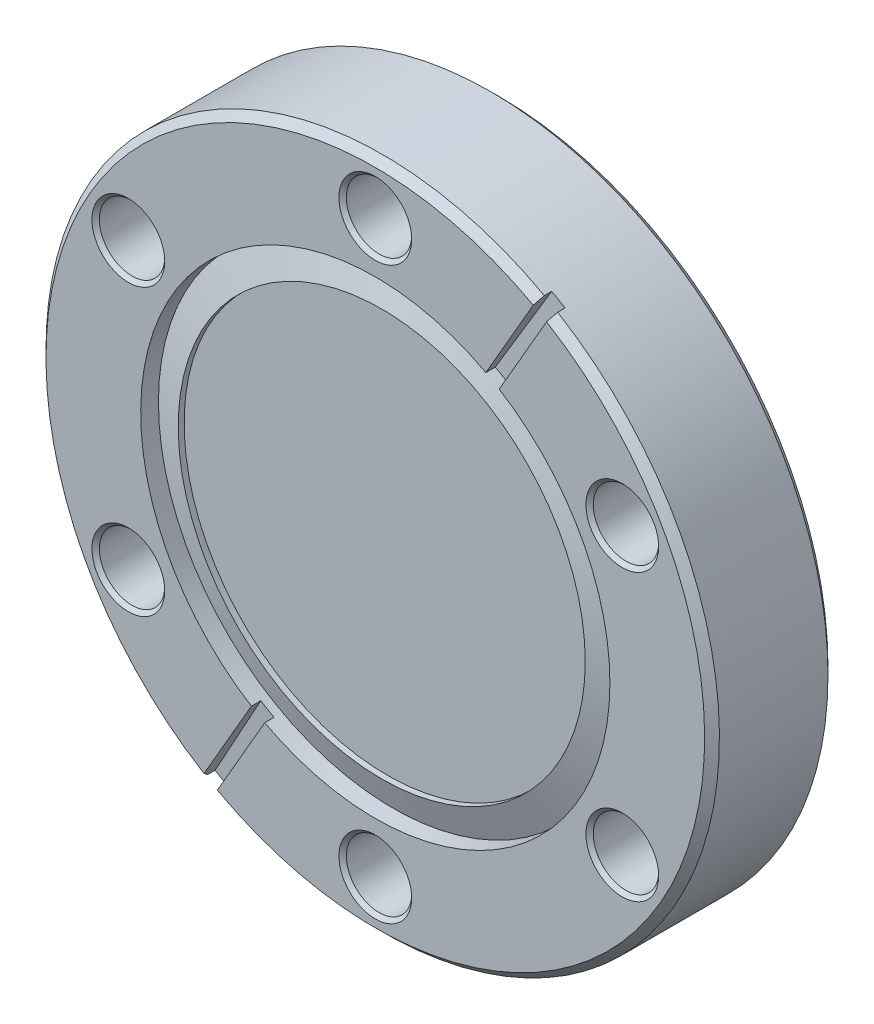
ISO-10303-21;
HEADER;
FILE_DESCRIPTION(('STEP AP214'),'2;1');
FILE_NAME('part.step','',(''),(''),'','','');
FILE_SCHEMA(('AUTOMOTIVE_DESIGN { 1 0 10303 214 1 1 1 1 }'));
ENDSEC;
DATA;
#1=APPLICATION_CONTEXT('core data for automotive mechanical design processes');
#2=APPLICATION_PROTOCOL_DEFINITION('international standard','automotive_design',2000,#1);
#3=PRODUCT_CONTEXT('',#1,'mechanical');
#4=PRODUCT('Part','Part','',(#3));
#5=PRODUCT_RELATED_PRODUCT_CATEGORY('part','',(#4));
#6=PRODUCT_DEFINITION_FORMATION('','',#4);
#7=PRODUCT_DEFINITION_CONTEXT('part definition',#1,'design');
#8=PRODUCT_DEFINITION('design','',#6,#7);
#9=PRODUCT_DEFINITION_SHAPE('','',#8);
#10=(LENGTH_UNIT() NAMED_UNIT(*) SI_UNIT(.MILLI.,.METRE.));
#11=(NAMED_UNIT(*) PLANE_ANGLE_UNIT() SI_UNIT($,.RADIAN.));
#12=(NAMED_UNIT(*) SI_UNIT($,.STERADIAN.) SOLID_ANGLE_UNIT());
#13=UNCERTAINTY_MEASURE_WITH_UNIT(LENGTH_MEASURE(1.E-05),#10,'distance_accuracy_value','');
#14=(GEOMETRIC_REPRESENTATION_CONTEXT(3) GLOBAL_UNCERTAINTY_ASSIGNED_CONTEXT((#13)) GLOBAL_UNIT_ASSIGNED_CONTEXT((#10,
#11,#12)) REPRESENTATION_CONTEXT('',''));
#15=CARTESIAN_POINT('',(0.,0.,0.));
#16=DIRECTION('',(0.,0.,1.));
#17=DIRECTION('',(1.,0.,0.));
#18=AXIS2_PLACEMENT_3D('',#15,#16,#17);
#19=CARTESIAN_POINT('',(0.,0.,-1.27));
#20=DIRECTION('',(0.,0.,1.));
#21=DIRECTION('',(1.,0.,0.));
#22=AXIS2_PLACEMENT_3D('',#19,#20,#21);
#23=PLANE('',#22);
#24=CARTESIAN_POINT('',(0.,0.,-1.27));
#25=DIRECTION('',(0.,0.,1.));
#26=DIRECTION('',(1.,0.,0.));
#27=AXIS2_PLACEMENT_3D('',#24,#25,#26);
#28=CIRCLE('',#27,20.955);
#29=CARTESIAN_POINT('',(20.955,0.,-1.27));
#30=VERTEX_POINT('',#29);
#31=EDGE_CURVE('E19',#30,#30,#28,.T.);
#32=ORIENTED_EDGE('',*,*,#31,.T.);
#33=EDGE_LOOP('',(#32));
#34=FACE_BOUND('',#33,.T.);
#35=ADVANCED_FACE('F16',(#34),#23,.T.);
#36=CARTESIAN_POINT('',(0.,0.,-1.91651285463287));
#37=DIRECTION('',(0.,0.,1.));
#38=DIRECTION('',(1.,0.,0.));
#39=AXIS2_PLACEMENT_3D('',#36,#37,#38);
#40=CYLINDRICAL_SURFACE('',#39,20.955);
#41=ORIENTED_EDGE('',*,*,#31,.F.);
#42=EDGE_LOOP('',(#41));
#43=FACE_BOUND('',#42,.T.);
#44=CARTESIAN_POINT('',(0.,0.,-0.660399999999613));
#45=DIRECTION('',(0.,0.,-1.));
#46=DIRECTION('',(0.,-1.,0.));
#47=AXIS2_PLACEMENT_3D('',#44,#45,#46);
#48=CIRCLE('',#47,20.9550000000001);
#49=CARTESIAN_POINT('',(0.,-20.9550000000001,-0.660399999999613));
#50=VERTEX_POINT('',#49);
#51=EDGE_CURVE('E314',#50,#50,#48,.T.);
#52=ORIENTED_EDGE('',*,*,#51,.F.);
#53=EDGE_LOOP('',(#52));
#54=FACE_BOUND('',#53,.T.);
#55=ADVANCED_FACE('F476',(#43,#54),#40,.F.);
#56=CARTESIAN_POINT('',(-11.1362923357452,-20.8761241334518,-0.9398));
#57=DIRECTION('',(-0.0261679781214693,-0.0453242676377388,0.998629534754574));
#58=DIRECTION('',(0.,-0.998971622769016,-0.0453397938045331));
#59=AXIS2_PLACEMENT_3D('',#56,#57,#58);
#60=PLANE('',#59);
#61=DIRECTION('',(-0.499314767377303,-0.864838546066885,-0.052335956242967));
#62=VECTOR('',#61,1.);
#63=CARTESIAN_POINT('',(-12.7585852175996,-20.5110178295789,-0.96573949798628));
#64=LINE('',#63,#62);
#65=CARTESIAN_POINT('',(-12.7585852175989,-20.511017829578,-0.965739497986328));
#66=VERTEX_POINT('',#65);
#67=CARTESIAN_POINT('',(-18.0183640857667,-29.6212220658211,-1.51704615798749));
#68=VERTEX_POINT('',#67);
#69=EDGE_CURVE('E124',#66,#68,#64,.T.);
#70=ORIENTED_EDGE('',*,*,#69,.T.);
#71=CARTESIAN_POINT('',(0.,0.,0.299507719817694));
#72=DIRECTION('',(-0.0261679781214693,-0.0453242676377388,0.998629534754574));
#73=DIRECTION('',(-0.499314767377261,-0.864838546066911,-0.0523359562429414));
#74=AXIS2_PLACEMENT_3D('',#71,#72,#73);
#75=ELLIPSE('',#74,34.7185806080939,34.671);
#76=CARTESIAN_POINT('',(-16.6435487572588,-30.4149720658206,-1.51704615798749));
#77=VERTEX_POINT('',#76);
#78=EDGE_CURVE('E366',#68,#77,#75,.T.);
#79=ORIENTED_EDGE('',*,*,#78,.T.);
#80=DIRECTION('',(-0.499314767377303,-0.864838546066885,-0.052335956242967));
#81=VECTOR('',#80,1.);
#82=CARTESIAN_POINT('',(-11.3837698890915,-21.3047678295781,-0.96573949798628));
#83=LINE('',#82,#81);
#84=CARTESIAN_POINT('',(-11.3837698890905,-21.3047678295783,-0.965739497986353));
#85=VERTEX_POINT('',#84);
#86=EDGE_CURVE('E313',#85,#77,#83,.T.);
#87=ORIENTED_EDGE('',*,*,#86,.F.);
#88=CARTESIAN_POINT('',(0.,0.,0.299507719817694));
#89=DIRECTION('',(-0.0261679781214693,-0.0453242676377388,0.998629534754574));
#90=DIRECTION('',(0.499314767377261,0.864838546066911,0.0523359562429414));
#91=AXIS2_PLACEMENT_3D('',#88,#89,#90);
#92=ELLIPSE('',#91,24.1885495665182,24.1554);
#93=EDGE_CURVE('E68',#85,#66,#92,.F.);
#94=ORIENTED_EDGE('',*,*,#93,.T.);
#95=EDGE_LOOP('',(#70,#79,#87,#94));
#96=FACE_BOUND('',#95,.T.);
#97=ADVANCED_FACE('F365',(#96),#60,.T.);
#98=CARTESIAN_POINT('',(12.5111076642548,20.0823741334518,-0.9398));
#99=DIRECTION('',(-0.0261679781214693,-0.0453242676377388,-0.998629534754574));
#100=DIRECTION('',(0.,0.998971622769016,-0.0453397938045331));
#101=AXIS2_PLACEMENT_3D('',#98,#99,#100);
#102=PLANE('',#101);
#103=CARTESIAN_POINT('',(0.,0.,0.29950771981774));
#104=DIRECTION('',(-0.0261679781214693,-0.0453242676377388,-0.998629534754574));
#105=DIRECTION('',(-0.499314767377261,-0.864838546066911,0.0523359562429414));
#106=AXIS2_PLACEMENT_3D('',#103,#104,#105);
#107=ELLIPSE('',#106,24.1885495665182,24.1554);
#108=CARTESIAN_POINT('',(12.7585852175989,20.511017829578,-0.965739497986305));
#109=VERTEX_POINT('',#108);
#110=CARTESIAN_POINT('',(11.3837698890905,21.3047678295783,-0.965739497986329));
#111=VERTEX_POINT('',#110);
#112=EDGE_CURVE('E316',#109,#111,#107,.F.);
#113=ORIENTED_EDGE('',*,*,#112,.F.);
#114=DIRECTION('',(0.499314767377303,0.864838546066885,-0.052335956242967));
#115=VECTOR('',#114,1.);
#116=CARTESIAN_POINT('',(12.7585852175996,20.5110178295789,-0.96573949798628));
#117=LINE('',#116,#115);
#118=CARTESIAN_POINT('',(18.0183640857667,29.6212220658211,-1.51704615798747));
#119=VERTEX_POINT('',#118);
#120=EDGE_CURVE('E119',#109,#119,#117,.T.);
#121=ORIENTED_EDGE('',*,*,#120,.T.);
#122=CARTESIAN_POINT('',(0.,0.,0.299507719817739));
#123=DIRECTION('',(-0.0261679781214693,-0.0453242676377388,-0.998629534754574));
#124=DIRECTION('',(0.499314767377261,0.864838546066911,-0.0523359562429414));
#125=AXIS2_PLACEMENT_3D('',#122,#123,#124);
#126=ELLIPSE('',#125,34.7185806080939,34.671);
#127=CARTESIAN_POINT('',(16.6435487572588,30.4149720658206,-1.51704615798747));
#128=VERTEX_POINT('',#127);
#129=EDGE_CURVE('E115',#128,#119,#126,.T.);
#130=ORIENTED_EDGE('',*,*,#129,.F.);
#131=DIRECTION('',(0.499314767377303,0.864838546066885,-0.052335956242967));
#132=VECTOR('',#131,1.);
#133=CARTESIAN_POINT('',(11.3837698890915,21.3047678295781,-0.96573949798628));
#134=LINE('',#133,#132);
#135=EDGE_CURVE('E304',#111,#128,#134,.T.);
#136=ORIENTED_EDGE('',*,*,#135,.F.);
#137=EDGE_LOOP('',(#113,#121,#130,#136));
#138=FACE_BOUND('',#137,.T.);
#139=ADVANCED_FACE('F373',(#138),#102,.F.);
#140=CARTESIAN_POINT('',(0.,0.,-1.8252503377459));
#141=DIRECTION('',(0.,0.,-1.));
#142=DIRECTION('',(-1.,0.,0.));
#143=AXIS2_PLACEMENT_3D('',#140,#141,#142);
#144=CONICAL_SURFACE('',#143,24.1553999999999,1.2217304763958);
#145=ORIENTED_EDGE('',*,*,#51,.T.);
#146=EDGE_LOOP('',(#145));
#147=FACE_BOUND('',#146,.T.);
#148=CARTESIAN_POINT('',(0.,0.,-1.82525033774552));
#149=DIRECTION('',(0.,0.,1.));
#150=DIRECTION('',(1.,0.,0.));
#151=AXIS2_PLACEMENT_3D('',#148,#149,#150);
#152=CIRCLE('',#151,24.1554);
#153=CARTESIAN_POINT('',(24.1554,0.,-1.82525033774552));
#154=VERTEX_POINT('',#153);
#155=EDGE_CURVE('E353',#154,#154,#152,.T.);
#156=ORIENTED_EDGE('',*,*,#155,.T.);
#157=EDGE_LOOP('',(#156));
#158=FACE_BOUND('',#157,.T.);
#159=ADVANCED_FACE('F468',(#147,#158),#144,.T.);
#160=CARTESIAN_POINT('',(0.687407664253804,-0.396875,0.));
#161=DIRECTION('',(-0.866025403784429,0.500000000000017,0.));
#162=DIRECTION('',(-0.500000000000017,-0.866025403784429,0.));
#163=AXIS2_PLACEMENT_3D('',#160,#161,#162);
#164=PLANE('',#163);
#165=DIRECTION('',(0.353600767688957,0.612454495232616,0.70701201429618));
#166=VECTOR('',#165,1.);
#167=CARTESIAN_POINT('',(-16.6435487572581,-30.4149720658194,-0.762));
#168=LINE('',#167,#166);
#169=CARTESIAN_POINT('',(-16.6435487572581,-30.4149720658194,-0.762));
#170=VERTEX_POINT('',#169);
#171=CARTESIAN_POINT('',(-16.2624466266971,-29.7548838128196,-4.00813280135304E-12));
#172=VERTEX_POINT('',#171);
#173=EDGE_CURVE('E34',#170,#172,#168,.T.);
#174=ORIENTED_EDGE('',*,*,#173,.T.);
#175=DIRECTION('',(0.499999999999777,0.866025403784567,0.));
#176=VECTOR('',#175,1.);
#177=CARTESIAN_POINT('',(-16.2624466266952,-29.754883812821,0.));
#178=LINE('',#177,#176);
#179=CARTESIAN_POINT('',(-11.3837698890897,-21.3047678295788,0.));
#180=VERTEX_POINT('',#179);
#181=EDGE_CURVE('E294',#172,#180,#178,.T.);
#182=ORIENTED_EDGE('',*,*,#181,.T.);
#183=DIRECTION('',(0.,0.,1.));
#184=VECTOR('',#183,1.);
#185=CARTESIAN_POINT('',(-11.3837698890897,-21.3047678295788,-1.91651285463287));
#186=LINE('',#185,#184);
#187=EDGE_CURVE('E357',#180,#85,#186,.F.);
#188=ORIENTED_EDGE('',*,*,#187,.T.);
#189=ORIENTED_EDGE('',*,*,#86,.T.);
#190=DIRECTION('',(0.,0.,1.));
#191=VECTOR('',#190,1.);
#192=CARTESIAN_POINT('',(-16.6435487572581,-30.4149720658194,0.));
#193=LINE('',#192,#191);
#194=EDGE_CURVE('E311',#77,#170,#193,.T.);
#195=ORIENTED_EDGE('',*,*,#194,.T.);
#196=EDGE_LOOP('',(#174,#182,#188,#189,#195));
#197=FACE_BOUND('',#196,.T.);
#198=ADVANCED_FACE('F180',(#197),#164,.T.);
#199=CARTESIAN_POINT('',(0.687407664253804,-0.396875,0.));
#200=DIRECTION('',(0.866025403784429,-0.500000000000017,0.));
#201=DIRECTION('',(0.500000000000017,0.866025403784429,0.));
#202=AXIS2_PLACEMENT_3D('',#199,#200,#201);
#203=PLANE('',#202);
#204=DIRECTION('',(0.,0.,1.));
#205=VECTOR('',#204,1.);
#206=CARTESIAN_POINT('',(18.0183640857662,29.6212220658203,0.));
#207=LINE('',#206,#205);
#208=CARTESIAN_POINT('',(18.0183640857667,29.6212220658211,-0.761999999999096));
#209=VERTEX_POINT('',#208);
#210=EDGE_CURVE('E112',#119,#209,#207,.T.);
#211=ORIENTED_EDGE('',*,*,#210,.F.);
#212=ORIENTED_EDGE('',*,*,#120,.F.);
#213=DIRECTION('',(0.,0.,1.));
#214=VECTOR('',#213,1.);
#215=CARTESIAN_POINT('',(12.7585852175988,20.511017829578,-1.91651285463287));
#216=LINE('',#215,#214);
#217=CARTESIAN_POINT('',(12.7585852175989,20.511017829578,0.));
#218=VERTEX_POINT('',#217);
#219=EDGE_CURVE('E296',#109,#218,#216,.T.);
#220=ORIENTED_EDGE('',*,*,#219,.T.);
#221=DIRECTION('',(0.499999999999582,0.86602540378468,0.));
#222=VECTOR('',#221,1.);
#223=CARTESIAN_POINT('',(12.7585852175995,20.511017829579,0.));
#224=LINE('',#223,#222);
#225=CARTESIAN_POINT('',(17.6372619552025,28.9611338128162,-4.03822320352923E-12));
#226=VERTEX_POINT('',#225);
#227=EDGE_CURVE('E122',#218,#226,#224,.T.);
#228=ORIENTED_EDGE('',*,*,#227,.T.);
#229=CARTESIAN_POINT('',(18.0183640857668,29.6212220658212,-0.76199999999933));
#230=CARTESIAN_POINT('',(17.9548472531625,29.5112076846147,-0.634999621586677));
#231=CARTESIAN_POINT('',(17.8913303259801,29.4011931395942,-0.507999432380747));
#232=CARTESIAN_POINT('',(17.7642962824594,29.1811637219255,-0.253999432382326));
#233=CARTESIAN_POINT('',(17.7007791661211,29.0711488492772,-0.126999621589835));
#234=CARTESIAN_POINT('',(17.6372619552047,28.9611338128149,-4.06656273588989E-12));
#235=B_SPLINE_CURVE_WITH_KNOTS('',3,(#229,#230,#231,#232,#233,#234),.UNSPECIFIED.,.F.,.F.,(4,2,
4),(0.,0.538887589315057,1.07777517863014),.UNSPECIFIED.);
#236=EDGE_CURVE('E104',#209,#226,#235,.T.);
#237=ORIENTED_EDGE('',*,*,#236,.F.);
#238=EDGE_LOOP('',(#211,#212,#220,#228,#237));
#239=FACE_BOUND('',#238,.T.);
#240=ADVANCED_FACE('F121',(#239),#203,.F.);
#241=CARTESIAN_POINT('',(-0.687407664253804,0.396875,0.));
#242=DIRECTION('',(-0.866025403784429,0.500000000000017,0.));
#243=DIRECTION('',(-0.500000000000017,-0.866025403784429,0.));
#244=AXIS2_PLACEMENT_3D('',#241,#242,#243);
#245=PLANE('',#244);
#246=DIRECTION('',(0.,0.,1.));
#247=VECTOR('',#246,1.);
#248=CARTESIAN_POINT('',(-18.0183640857662,-29.6212220658203,0.));
#249=LINE('',#248,#247);
#250=CARTESIAN_POINT('',(-18.0183640857667,-29.6212220658211,-0.761999999999096));
#251=VERTEX_POINT('',#250);
#252=EDGE_CURVE('E126',#68,#251,#249,.T.);
#253=ORIENTED_EDGE('',*,*,#252,.F.);
#254=ORIENTED_EDGE('',*,*,#69,.F.);
#255=DIRECTION('',(0.,0.,1.));
#256=VECTOR('',#255,1.);
#257=CARTESIAN_POINT('',(-12.7585852175988,-20.511017829578,-1.91651285463287));
#258=LINE('',#257,#256);
#259=CARTESIAN_POINT('',(-12.7585852175989,-20.511017829578,0.));
#260=VERTEX_POINT('',#259);
#261=EDGE_CURVE('E354',#66,#260,#258,.T.);
#262=ORIENTED_EDGE('',*,*,#261,.T.);
#263=DIRECTION('',(-0.499999999999582,-0.86602540378468,0.));
#264=VECTOR('',#263,1.);
#265=CARTESIAN_POINT('',(-12.7585852175995,-20.511017829579,0.));
#266=LINE('',#265,#264);
#267=CARTESIAN_POINT('',(-17.6372619552025,-28.9611338128162,-4.0364891588711E-12));
#268=VERTEX_POINT('',#267);
#269=EDGE_CURVE('E346',#260,#268,#266,.T.);
#270=ORIENTED_EDGE('',*,*,#269,.T.);
#271=CARTESIAN_POINT('',(-18.0183640857668,-29.6212220658212,-0.76199999999933));
#272=CARTESIAN_POINT('',(-17.9548472531625,-29.5112076846147,-0.634999621586677));
#273=CARTESIAN_POINT('',(-17.8913303259801,-29.4011931395942,-0.507999432380747));
#274=CARTESIAN_POINT('',(-17.7642962824594,-29.1811637219255,-0.253999432382326));
#275=CARTESIAN_POINT('',(-17.7007791661211,-29.0711488492772,-0.126999621589835));
#276=CARTESIAN_POINT('',(-17.6372619552047,-28.9611338128149,-4.06626845563363E-12));
#277=B_SPLINE_CURVE_WITH_KNOTS('',3,(#271,#272,#273,#274,#275,#276),.UNSPECIFIED.,.F.,.F.,(4,2,
4),(0.,0.538887589315058,1.07777517863015),.UNSPECIFIED.);
#278=EDGE_CURVE('E136',#251,#268,#277,.T.);
#279=ORIENTED_EDGE('',*,*,#278,.F.);
#280=EDGE_LOOP('',(#253,#254,#262,#270,#279));
#281=FACE_BOUND('',#280,.T.);
#282=ADVANCED_FACE('F171',(#281),#245,.F.);
#283=CARTESIAN_POINT('',(-0.687407664253804,0.396875,0.));
#284=DIRECTION('',(0.866025403784429,-0.500000000000017,0.));
#285=DIRECTION('',(0.500000000000017,0.866025403784429,0.));
#286=AXIS2_PLACEMENT_3D('',#283,#284,#285);
#287=PLANE('',#286);
#288=DIRECTION('',(-0.353600767688957,-0.612454495232616,0.70701201429618));
#289=VECTOR('',#288,1.);
#290=CARTESIAN_POINT('',(16.6435487572581,30.4149720658194,-0.762));
#291=LINE('',#290,#289);
#292=CARTESIAN_POINT('',(16.6435487572581,30.4149720658194,-0.762));
#293=VERTEX_POINT('',#292);
#294=CARTESIAN_POINT('',(16.2624466266971,29.7548838128196,-4.00813280135304E-12));
#295=VERTEX_POINT('',#294);
#296=EDGE_CURVE('E295',#293,#295,#291,.T.);
#297=ORIENTED_EDGE('',*,*,#296,.T.);
#298=DIRECTION('',(-0.499999999999777,-0.866025403784567,0.));
#299=VECTOR('',#298,1.);
#300=CARTESIAN_POINT('',(16.2624466266952,29.754883812821,0.));
#301=LINE('',#300,#299);
#302=CARTESIAN_POINT('',(11.3837698890897,21.3047678295788,0.));
#303=VERTEX_POINT('',#302);
#304=EDGE_CURVE('E293',#295,#303,#301,.T.);
#305=ORIENTED_EDGE('',*,*,#304,.T.);
#306=DIRECTION('',(0.,0.,1.));
#307=VECTOR('',#306,1.);
#308=CARTESIAN_POINT('',(11.3837698890897,21.3047678295788,-1.91651285463287));
#309=LINE('',#308,#307);
#310=EDGE_CURVE('E302',#303,#111,#309,.F.);
#311=ORIENTED_EDGE('',*,*,#310,.T.);
#312=ORIENTED_EDGE('',*,*,#135,.T.);
#313=DIRECTION('',(0.,0.,1.));
#314=VECTOR('',#313,1.);
#315=CARTESIAN_POINT('',(16.6435487572581,30.4149720658194,0.));
#316=LINE('',#315,#314);
#317=EDGE_CURVE('E297',#128,#293,#316,.T.);
#318=ORIENTED_EDGE('',*,*,#317,.T.);
#319=EDGE_LOOP('',(#297,#305,#311,#312,#318));
#320=FACE_BOUND('',#319,.T.);
#321=ADVANCED_FACE('F168',(#320),#287,.T.);
#322=CARTESIAN_POINT('',(0.,0.,-1.91651285463287));
#323=DIRECTION('',(0.,0.,1.));
#324=DIRECTION('',(1.,0.,0.));
#325=AXIS2_PLACEMENT_3D('',#322,#323,#324);
#326=CYLINDRICAL_SURFACE('',#325,24.1554);
#327=ORIENTED_EDGE('',*,*,#155,.F.);
#328=EDGE_LOOP('',(#327));
#329=FACE_BOUND('',#328,.T.);
#330=ORIENTED_EDGE('',*,*,#187,.F.);
#331=CARTESIAN_POINT('',(0.,0.,0.));
#332=DIRECTION('',(0.,0.,1.));
#333=DIRECTION('',(1.,0.,0.));
#334=AXIS2_PLACEMENT_3D('',#331,#332,#333);
#335=CIRCLE('',#334,24.1554);
#336=EDGE_CURVE('E80',#180,#218,#335,.T.);
#337=ORIENTED_EDGE('',*,*,#336,.T.);
#338=ORIENTED_EDGE('',*,*,#219,.F.);
#339=ORIENTED_EDGE('',*,*,#112,.T.);
#340=ORIENTED_EDGE('',*,*,#310,.F.);
#341=CARTESIAN_POINT('',(0.,0.,0.));
#342=DIRECTION('',(0.,0.,1.));
#343=DIRECTION('',(1.,0.,0.));
#344=AXIS2_PLACEMENT_3D('',#341,#342,#343);
#345=CIRCLE('',#344,24.1554);
#346=EDGE_CURVE('E290',#303,#260,#345,.T.);
#347=ORIENTED_EDGE('',*,*,#346,.T.);
#348=ORIENTED_EDGE('',*,*,#261,.F.);
#349=ORIENTED_EDGE('',*,*,#93,.F.);
#350=EDGE_LOOP('',(#330,#337,#338,#339,#340,#347,#348,#349));
#351=FACE_BOUND('',#350,.T.);
#352=ADVANCED_FACE('F164',(#329,#351),#326,.F.);
#353=CARTESIAN_POINT('',(0.,0.,0.));
#354=DIRECTION('',(0.,0.,-1.));
#355=DIRECTION('',(-1.,0.,0.));
#356=AXIS2_PLACEMENT_3D('',#353,#354,#355);
#357=PLANE('',#356);
#358=CARTESIAN_POINT('',(0.,-29.3624,0.));
#359=DIRECTION('',(0.,0.,1.));
#360=DIRECTION('',(1.,0.,0.));
#361=AXIS2_PLACEMENT_3D('',#358,#359,#360);
#362=CIRCLE('',#361,3.74650000003385);
#363=CARTESIAN_POINT('',(3.74650000003385,-29.3624,0.));
#364=VERTEX_POINT('',#363);
#365=EDGE_CURVE('E279',#364,#364,#362,.F.);
#366=ORIENTED_EDGE('',*,*,#365,.T.);
#367=EDGE_LOOP('',(#366));
#368=FACE_BOUND('',#367,.T.);
#369=CARTESIAN_POINT('',(25.428584316085,-14.6812,0.));
#370=DIRECTION('',(0.,0.,1.));
#371=DIRECTION('',(1.,0.,0.));
#372=AXIS2_PLACEMENT_3D('',#369,#370,#371);
#373=CIRCLE('',#372,3.74650000005169);
#374=CARTESIAN_POINT('',(29.1750843161367,-14.6812,0.));
#375=VERTEX_POINT('',#374);
#376=EDGE_CURVE('E275',#375,#375,#373,.F.);
#377=ORIENTED_EDGE('',*,*,#376,.T.);
#378=EDGE_LOOP('',(#377));
#379=FACE_BOUND('',#378,.T.);
#380=CARTESIAN_POINT('',(25.428584316085,14.6812,0.));
#381=DIRECTION('',(0.,0.,1.));
#382=DIRECTION('',(1.,0.,0.));
#383=AXIS2_PLACEMENT_3D('',#380,#381,#382);
#384=CIRCLE('',#383,3.74650000005169);
#385=CARTESIAN_POINT('',(29.1750843161367,14.6812,0.));
#386=VERTEX_POINT('',#385);
#387=EDGE_CURVE('E273',#386,#386,#384,.F.);
#388=ORIENTED_EDGE('',*,*,#387,.T.);
#389=EDGE_LOOP('',(#388));
#390=FACE_BOUND('',#389,.T.);
#391=ORIENTED_EDGE('',*,*,#227,.F.);
#392=ORIENTED_EDGE('',*,*,#336,.F.);
#393=ORIENTED_EDGE('',*,*,#181,.F.);
#394=CARTESIAN_POINT('',(0.,0.,-4.00818701146166E-12));
#395=DIRECTION('',(0.,0.,-1.));
#396=DIRECTION('',(-1.,0.,0.));
#397=AXIS2_PLACEMENT_3D('',#394,#395,#396);
#398=CIRCLE('',#397,33.9090000000041);
#399=EDGE_CURVE('E282',#226,#172,#398,.T.);
#400=ORIENTED_EDGE('',*,*,#399,.F.);
#401=EDGE_LOOP('',(#391,#392,#393,#400));
#402=FACE_BOUND('',#401,.T.);
#403=ADVANCED_FACE('F160',(#368,#379,#390,#402),#357,.F.);
#404=CARTESIAN_POINT('',(0.,0.,0.));
#405=DIRECTION('',(0.,0.,-1.));
#406=DIRECTION('',(-1.,0.,0.));
#407=AXIS2_PLACEMENT_3D('',#404,#405,#406);
#408=PLANE('',#407);
#409=CARTESIAN_POINT('',(-25.428584316085,14.6812,0.));
#410=DIRECTION('',(0.,0.,1.));
#411=DIRECTION('',(1.,0.,0.));
#412=AXIS2_PLACEMENT_3D('',#409,#410,#411);
#413=CIRCLE('',#412,3.74649999995916);
#414=CARTESIAN_POINT('',(-21.6820843161258,14.6812,0.));
#415=VERTEX_POINT('',#414);
#416=EDGE_CURVE('E336',#415,#415,#413,.F.);
#417=ORIENTED_EDGE('',*,*,#416,.T.);
#418=EDGE_LOOP('',(#417));
#419=FACE_BOUND('',#418,.T.);
#420=CARTESIAN_POINT('',(-25.428584316085,-14.6812,0.));
#421=DIRECTION('',(0.,0.,1.));
#422=DIRECTION('',(1.,0.,0.));
#423=AXIS2_PLACEMENT_3D('',#420,#421,#422);
#424=CIRCLE('',#423,3.74649999995916);
#425=CARTESIAN_POINT('',(-21.6820843161258,-14.6812,0.));
#426=VERTEX_POINT('',#425);
#427=EDGE_CURVE('E339',#426,#426,#424,.F.);
#428=ORIENTED_EDGE('',*,*,#427,.T.);
#429=EDGE_LOOP('',(#428));
#430=FACE_BOUND('',#429,.T.);
#431=CARTESIAN_POINT('',(0.,29.3624,0.));
#432=DIRECTION('',(0.,0.,1.));
#433=DIRECTION('',(1.,0.,0.));
#434=AXIS2_PLACEMENT_3D('',#431,#432,#433);
#435=CIRCLE('',#434,3.74650000003385);
#436=CARTESIAN_POINT('',(3.74650000003385,29.3624,0.));
#437=VERTEX_POINT('',#436);
#438=EDGE_CURVE('E276',#437,#437,#435,.F.);
#439=ORIENTED_EDGE('',*,*,#438,.T.);
#440=EDGE_LOOP('',(#439));
#441=FACE_BOUND('',#440,.T.);
#442=ORIENTED_EDGE('',*,*,#346,.F.);
#443=ORIENTED_EDGE('',*,*,#304,.F.);
#444=CARTESIAN_POINT('',(0.,0.,-4.00818701146166E-12));
#445=DIRECTION('',(0.,0.,-1.));
#446=DIRECTION('',(-1.,0.,0.));
#447=AXIS2_PLACEMENT_3D('',#444,#445,#446);
#448=CIRCLE('',#447,33.9090000000041);
#449=EDGE_CURVE('E287',#268,#295,#448,.T.);
#450=ORIENTED_EDGE('',*,*,#449,.F.);
#451=ORIENTED_EDGE('',*,*,#269,.F.);
#452=EDGE_LOOP('',(#442,#443,#450,#451));
#453=FACE_BOUND('',#452,.T.);
#454=ADVANCED_FACE('F156',(#419,#430,#441,#453),#408,.F.);
#455=CARTESIAN_POINT('',(0.,0.,-0.762000000000056));
#456=DIRECTION('',(0.,0.,-1.));
#457=DIRECTION('',(-1.,0.,0.));
#458=AXIS2_PLACEMENT_3D('',#455,#456,#457);
#459=CONICAL_SURFACE('',#458,34.6709999999999,0.7853981633973);
#460=CARTESIAN_POINT('',(0.,0.,-0.762));
#461=DIRECTION('',(0.,0.,-1.));
#462=DIRECTION('',(-1.,0.,0.));
#463=AXIS2_PLACEMENT_3D('',#460,#461,#462);
#464=CIRCLE('',#463,34.671);
#465=EDGE_CURVE('E109',#251,#293,#464,.T.);
#466=ORIENTED_EDGE('',*,*,#465,.F.);
#467=ORIENTED_EDGE('',*,*,#278,.T.);
#468=ORIENTED_EDGE('',*,*,#449,.T.);
#469=ORIENTED_EDGE('',*,*,#296,.F.);
#470=EDGE_LOOP('',(#466,#467,#468,#469));
#471=FACE_BOUND('',#470,.T.);
#472=ADVANCED_FACE('F151',(#471),#459,.T.);
#473=CARTESIAN_POINT('',(0.,0.,-0.762000000000056));
#474=DIRECTION('',(0.,0.,-1.));
#475=DIRECTION('',(-1.,0.,0.));
#476=AXIS2_PLACEMENT_3D('',#473,#474,#475);
#477=CONICAL_SURFACE('',#476,34.6709999999999,0.7853981633973);
#478=ORIENTED_EDGE('',*,*,#399,.T.);
#479=ORIENTED_EDGE('',*,*,#173,.F.);
#480=CARTESIAN_POINT('',(0.,0.,-0.762));
#481=DIRECTION('',(0.,0.,-1.));
#482=DIRECTION('',(-1.,0.,0.));
#483=AXIS2_PLACEMENT_3D('',#480,#481,#482);
#484=CIRCLE('',#483,34.671);
#485=EDGE_CURVE('E99',#209,#170,#484,.T.);
#486=ORIENTED_EDGE('',*,*,#485,.F.);
#487=ORIENTED_EDGE('',*,*,#236,.T.);
#488=EDGE_LOOP('',(#478,#479,#486,#487));
#489=FACE_BOUND('',#488,.T.);
#490=ADVANCED_FACE('F102',(#489),#477,.T.);
#491=CARTESIAN_POINT('',(0.,29.3624,-1.13686837721616E-10));
#492=DIRECTION('',(0.,0.,1.));
#493=DIRECTION('',(1.,0.,0.));
#494=AXIS2_PLACEMENT_3D('',#491,#492,#493);
#495=CONICAL_SURFACE('',#494,3.74649999992016,0.785398163397448);
#496=CARTESIAN_POINT('',(0.,29.3624,-0.381));
#497=DIRECTION('',(0.,0.,-1.));
#498=DIRECTION('',(-1.,0.,0.));
#499=AXIS2_PLACEMENT_3D('',#496,#497,#498);
#500=CIRCLE('',#499,3.3655);
#501=CARTESIAN_POINT('',(-3.3655,29.3624,-0.381));
#502=VERTEX_POINT('',#501);
#503=EDGE_CURVE('E108',#502,#502,#500,.T.);
#504=ORIENTED_EDGE('',*,*,#503,.T.);
#505=EDGE_LOOP('',(#504));
#506=FACE_BOUND('',#505,.T.);
#507=ORIENTED_EDGE('',*,*,#438,.F.);
#508=EDGE_LOOP('',(#507));
#509=FACE_BOUND('',#508,.T.);
#510=ADVANCED_FACE('F150',(#506,#509),#495,.F.);
#511=CARTESIAN_POINT('',(25.428584316085,14.6812,0.));
#512=DIRECTION('',(0.,0.,1.));
#513=DIRECTION('',(1.,0.,0.));
#514=AXIS2_PLACEMENT_3D('',#511,#512,#513);
#515=CONICAL_SURFACE('',#514,3.74650000005169,0.785398163397448);
#516=CARTESIAN_POINT('',(25.428584316085,14.6812,-0.381));
#517=DIRECTION('',(0.,0.,-1.));
#518=DIRECTION('',(-1.,0.,0.));
#519=AXIS2_PLACEMENT_3D('',#516,#517,#518);
#520=CIRCLE('',#519,3.3655);
#521=CARTESIAN_POINT('',(22.063084316085,14.6812,-0.381));
#522=VERTEX_POINT('',#521);
#523=EDGE_CURVE('E270',#522,#522,#520,.T.);
#524=ORIENTED_EDGE('',*,*,#523,.T.);
#525=EDGE_LOOP('',(#524));
#526=FACE_BOUND('',#525,.T.);
#527=ORIENTED_EDGE('',*,*,#387,.F.);
#528=EDGE_LOOP('',(#527));
#529=FACE_BOUND('',#528,.T.);
#530=ADVANCED_FACE('F259',(#526,#529),#515,.F.);
#531=CARTESIAN_POINT('',(25.428584316085,-14.6812,0.));
#532=DIRECTION('',(0.,0.,1.));
#533=DIRECTION('',(1.,0.,0.));
#534=AXIS2_PLACEMENT_3D('',#531,#532,#533);
#535=CONICAL_SURFACE('',#534,3.74650000005169,0.785398163397448);
#536=CARTESIAN_POINT('',(25.428584316085,-14.6812,-0.381));
#537=DIRECTION('',(0.,0.,-1.));
#538=DIRECTION('',(-1.,0.,0.));
#539=AXIS2_PLACEMENT_3D('',#536,#537,#538);
#540=CIRCLE('',#539,3.3655);
#541=CARTESIAN_POINT('',(22.063084316085,-14.6812,-0.381));
#542=VERTEX_POINT('',#541);
#543=EDGE_CURVE('E386',#542,#542,#540,.T.);
#544=ORIENTED_EDGE('',*,*,#543,.T.);
#545=EDGE_LOOP('',(#544));
#546=FACE_BOUND('',#545,.T.);
#547=ORIENTED_EDGE('',*,*,#376,.F.);
#548=EDGE_LOOP('',(#547));
#549=FACE_BOUND('',#548,.T.);
#550=ADVANCED_FACE('F256',(#546,#549),#535,.F.);
#551=CARTESIAN_POINT('',(0.,-29.3624,-1.13686837721616E-10));
#552=DIRECTION('',(0.,0.,1.));
#553=DIRECTION('',(1.,0.,0.));
#554=AXIS2_PLACEMENT_3D('',#551,#552,#553);
#555=CONICAL_SURFACE('',#554,3.74649999992016,0.785398163397448);
#556=CARTESIAN_POINT('',(0.,-29.3624,-0.381));
#557=DIRECTION('',(0.,0.,-1.));
#558=DIRECTION('',(-1.,0.,0.));
#559=AXIS2_PLACEMENT_3D('',#556,#557,#558);
#560=CIRCLE('',#559,3.3655);
#561=CARTESIAN_POINT('',(-3.3655,-29.3624,-0.381));
#562=VERTEX_POINT('',#561);
#563=EDGE_CURVE('E389',#562,#562,#560,.T.);
#564=ORIENTED_EDGE('',*,*,#563,.T.);
#565=EDGE_LOOP('',(#564));
#566=FACE_BOUND('',#565,.T.);
#567=ORIENTED_EDGE('',*,*,#365,.F.);
#568=EDGE_LOOP('',(#567));
#569=FACE_BOUND('',#568,.T.);
#570=ADVANCED_FACE('F252',(#566,#569),#555,.F.);
#571=CARTESIAN_POINT('',(-25.428584316085,-14.6812,-5.6843418860808E-11));
#572=DIRECTION('',(0.,0.,1.));
#573=DIRECTION('',(1.,0.,0.));
#574=AXIS2_PLACEMENT_3D('',#571,#572,#573);
#575=CONICAL_SURFACE('',#574,3.74649999990232,0.785398163397448);
#576=CARTESIAN_POINT('',(-25.428584316085,-14.6812,-0.381));
#577=DIRECTION('',(0.,0.,-1.));
#578=DIRECTION('',(-1.,0.,0.));
#579=AXIS2_PLACEMENT_3D('',#576,#577,#578);
#580=CIRCLE('',#579,3.3655);
#581=CARTESIAN_POINT('',(-28.794084316085,-14.6812,-0.381));
#582=VERTEX_POINT('',#581);
#583=EDGE_CURVE('E392',#582,#582,#580,.T.);
#584=ORIENTED_EDGE('',*,*,#583,.T.);
#585=EDGE_LOOP('',(#584));
#586=FACE_BOUND('',#585,.T.);
#587=ORIENTED_EDGE('',*,*,#427,.F.);
#588=EDGE_LOOP('',(#587));
#589=FACE_BOUND('',#588,.T.);
#590=ADVANCED_FACE('F248',(#586,#589),#575,.F.);
#591=CARTESIAN_POINT('',(-25.428584316085,14.6812,-5.6843418860808E-11));
#592=DIRECTION('',(0.,0.,1.));
#593=DIRECTION('',(1.,0.,0.));
#594=AXIS2_PLACEMENT_3D('',#591,#592,#593);
#595=CONICAL_SURFACE('',#594,3.74649999990232,0.785398163397448);
#596=CARTESIAN_POINT('',(-25.428584316085,14.6812,-0.381));
#597=DIRECTION('',(0.,0.,-1.));
#598=DIRECTION('',(-1.,0.,0.));
#599=AXIS2_PLACEMENT_3D('',#596,#597,#598);
#600=CIRCLE('',#599,3.3655);
#601=CARTESIAN_POINT('',(-28.794084316085,14.6812,-0.381));
#602=VERTEX_POINT('',#601);
#603=EDGE_CURVE('E395',#602,#602,#600,.T.);
#604=ORIENTED_EDGE('',*,*,#603,.T.);
#605=EDGE_LOOP('',(#604));
#606=FACE_BOUND('',#605,.T.);
#607=ORIENTED_EDGE('',*,*,#416,.F.);
#608=EDGE_LOOP('',(#607));
#609=FACE_BOUND('',#608,.T.);
#610=ADVANCED_FACE('F244',(#606,#609),#595,.F.);
#611=CARTESIAN_POINT('',(0.,0.,0.));
#612=DIRECTION('',(0.,0.,-1.));
#613=DIRECTION('',(-1.,0.,0.));
#614=AXIS2_PLACEMENT_3D('',#611,#612,#613);
#615=CYLINDRICAL_SURFACE('',#614,34.671);
#616=CARTESIAN_POINT('',(0.,0.,-11.9379999999999));
#617=DIRECTION('',(0.,0.,1.));
#618=DIRECTION('',(0.,1.,0.));
#619=AXIS2_PLACEMENT_3D('',#616,#617,#618);
#620=CIRCLE('',#619,34.6709999999999);
#621=CARTESIAN_POINT('',(0.,34.6709999999999,-11.9379999999999));
#622=VERTEX_POINT('',#621);
#623=EDGE_CURVE('E398',#622,#622,#620,.F.);
#624=ORIENTED_EDGE('',*,*,#623,.F.);
#625=EDGE_LOOP('',(#624));
#626=FACE_BOUND('',#625,.T.);
#627=ORIENTED_EDGE('',*,*,#485,.T.);
#628=ORIENTED_EDGE('',*,*,#194,.F.);
#629=ORIENTED_EDGE('',*,*,#78,.F.);
#630=ORIENTED_EDGE('',*,*,#252,.T.);
#631=ORIENTED_EDGE('',*,*,#465,.T.);
#632=ORIENTED_EDGE('',*,*,#317,.F.);
#633=ORIENTED_EDGE('',*,*,#129,.T.);
#634=ORIENTED_EDGE('',*,*,#210,.T.);
#635=EDGE_LOOP('',(#627,#628,#629,#630,#631,#632,#633,#634));
#636=FACE_BOUND('',#635,.T.);
#637=ADVANCED_FACE('F113',(#626,#636),#615,.T.);
#638=CARTESIAN_POINT('',(0.,29.3624,0.));
#639=DIRECTION('',(0.,0.,-1.));
#640=DIRECTION('',(-1.,0.,0.));
#641=AXIS2_PLACEMENT_3D('',#638,#639,#640);
#642=CYLINDRICAL_SURFACE('',#641,3.3655);
#643=CARTESIAN_POINT('',(0.,29.3624,-12.3190000000477));
#644=DIRECTION('',(0.,0.,-1.));
#645=DIRECTION('',(-1.,0.,0.));
#646=AXIS2_PLACEMENT_3D('',#643,#644,#645);
#647=CIRCLE('',#646,3.36550000002944);
#648=CARTESIAN_POINT('',(-3.36550000002944,29.3624,-12.3190000000477));
#649=VERTEX_POINT('',#648);
#650=EDGE_CURVE('E401',#649,#649,#647,.T.);
#651=ORIENTED_EDGE('',*,*,#650,.T.);
#652=EDGE_LOOP('',(#651));
#653=FACE_BOUND('',#652,.T.);
#654=ORIENTED_EDGE('',*,*,#503,.F.);
#655=EDGE_LOOP('',(#654));
#656=FACE_BOUND('',#655,.T.);
#657=ADVANCED_FACE('F237',(#653,#656),#642,.F.);
#658=CARTESIAN_POINT('',(25.428584316085,14.6812,0.));
#659=DIRECTION('',(0.,0.,-1.));
#660=DIRECTION('',(-1.,0.,0.));
#661=AXIS2_PLACEMENT_3D('',#658,#659,#660);
#662=CYLINDRICAL_SURFACE('',#661,3.3655);
#663=CARTESIAN_POINT('',(25.428584316085,14.6812,-12.3190000000477));
#664=DIRECTION('',(0.,0.,-1.));
#665=DIRECTION('',(-1.,0.,0.));
#666=AXIS2_PLACEMENT_3D('',#663,#664,#665);
#667=CIRCLE('',#666,3.3655000000116);
#668=CARTESIAN_POINT('',(22.0630843160734,14.6812,-12.3190000000477));
#669=VERTEX_POINT('',#668);
#670=EDGE_CURVE('E404',#669,#669,#667,.T.);
#671=ORIENTED_EDGE('',*,*,#670,.T.);
#672=EDGE_LOOP('',(#671));
#673=FACE_BOUND('',#672,.T.);
#674=ORIENTED_EDGE('',*,*,#523,.F.);
#675=EDGE_LOOP('',(#674));
#676=FACE_BOUND('',#675,.T.);
#677=ADVANCED_FACE('F233',(#673,#676),#662,.F.);
#678=CARTESIAN_POINT('',(25.428584316085,-14.6812,0.));
#679=DIRECTION('',(0.,0.,-1.));
#680=DIRECTION('',(-1.,0.,0.));
#681=AXIS2_PLACEMENT_3D('',#678,#679,#680);
#682=CYLINDRICAL_SURFACE('',#681,3.3655);
#683=CARTESIAN_POINT('',(25.428584316085,-14.6812,-12.3190000000477));
#684=DIRECTION('',(0.,0.,-1.));
#685=DIRECTION('',(-1.,0.,0.));
#686=AXIS2_PLACEMENT_3D('',#683,#684,#685);
#687=CIRCLE('',#686,3.3655000000116);
#688=CARTESIAN_POINT('',(22.0630843160734,-14.6812,-12.3190000000477));
#689=VERTEX_POINT('',#688);
#690=EDGE_CURVE('E407',#689,#689,#687,.T.);
#691=ORIENTED_EDGE('',*,*,#690,.T.);
#692=EDGE_LOOP('',(#691));
#693=FACE_BOUND('',#692,.T.);
#694=ORIENTED_EDGE('',*,*,#543,.F.);
#695=EDGE_LOOP('',(#694));
#696=FACE_BOUND('',#695,.T.);
#697=ADVANCED_FACE('F229',(#693,#696),#682,.F.);
#698=CARTESIAN_POINT('',(0.,-29.3624,0.));
#699=DIRECTION('',(0.,0.,-1.));
#700=DIRECTION('',(-1.,0.,0.));
#701=AXIS2_PLACEMENT_3D('',#698,#699,#700);
#702=CYLINDRICAL_SURFACE('',#701,3.3655);
#703=CARTESIAN_POINT('',(0.,-29.3624,-12.3190000000477));
#704=DIRECTION('',(0.,0.,-1.));
#705=DIRECTION('',(-1.,0.,0.));
#706=AXIS2_PLACEMENT_3D('',#703,#704,#705);
#707=CIRCLE('',#706,3.36550000002944);
#708=CARTESIAN_POINT('',(-3.36550000002944,-29.3624,-12.3190000000477));
#709=VERTEX_POINT('',#708);
#710=EDGE_CURVE('E410',#709,#709,#707,.T.);
#711=ORIENTED_EDGE('',*,*,#710,.T.);
#712=EDGE_LOOP('',(#711));
#713=FACE_BOUND('',#712,.T.);
#714=ORIENTED_EDGE('',*,*,#563,.F.);
#715=EDGE_LOOP('',(#714));
#716=FACE_BOUND('',#715,.T.);
#717=ADVANCED_FACE('F225',(#713,#716),#702,.F.);
#718=CARTESIAN_POINT('',(-25.428584316085,-14.6812,0.));
#719=DIRECTION('',(0.,0.,-1.));
#720=DIRECTION('',(-1.,0.,0.));
#721=AXIS2_PLACEMENT_3D('',#718,#719,#720);
#722=CYLINDRICAL_SURFACE('',#721,3.3655);
#723=CARTESIAN_POINT('',(-25.428584316085,-14.6812,-12.318999999934));
#724=DIRECTION('',(0.,0.,-1.));
#725=DIRECTION('',(-1.,0.,0.));
#726=AXIS2_PLACEMENT_3D('',#723,#724,#725);
#727=CIRCLE('',#726,3.36549999999044);
#728=CARTESIAN_POINT('',(-28.7940843160754,-14.6812,-12.318999999934));
#729=VERTEX_POINT('',#728);
#730=EDGE_CURVE('E413',#729,#729,#727,.T.);
#731=ORIENTED_EDGE('',*,*,#730,.T.);
#732=EDGE_LOOP('',(#731));
#733=FACE_BOUND('',#732,.T.);
#734=ORIENTED_EDGE('',*,*,#583,.F.);
#735=EDGE_LOOP('',(#734));
#736=FACE_BOUND('',#735,.T.);
#737=ADVANCED_FACE('F221',(#733,#736),#722,.F.);
#738=CARTESIAN_POINT('',(-25.428584316085,14.6812,0.));
#739=DIRECTION('',(0.,0.,-1.));
#740=DIRECTION('',(-1.,0.,0.));
#741=AXIS2_PLACEMENT_3D('',#738,#739,#740);
#742=CYLINDRICAL_SURFACE('',#741,3.3655);
#743=CARTESIAN_POINT('',(-25.428584316085,14.6812,-12.318999999934));
#744=DIRECTION('',(0.,0.,-1.));
#745=DIRECTION('',(-1.,0.,0.));
#746=AXIS2_PLACEMENT_3D('',#743,#744,#745);
#747=CIRCLE('',#746,3.36549999999044);
#748=CARTESIAN_POINT('',(-28.7940843160754,14.6812,-12.318999999934));
#749=VERTEX_POINT('',#748);
#750=EDGE_CURVE('E335',#749,#749,#747,.T.);
#751=ORIENTED_EDGE('',*,*,#750,.T.);
#752=EDGE_LOOP('',(#751));
#753=FACE_BOUND('',#752,.T.);
#754=ORIENTED_EDGE('',*,*,#603,.F.);
#755=EDGE_LOOP('',(#754));
#756=FACE_BOUND('',#755,.T.);
#757=ADVANCED_FACE('F217',(#753,#756),#742,.F.);
#758=CARTESIAN_POINT('',(0.,0.,-11.9379999999999));
#759=DIRECTION('',(0.,0.,1.));
#760=DIRECTION('',(1.,0.,0.));
#761=AXIS2_PLACEMENT_3D('',#758,#759,#760);
#762=CONICAL_SURFACE('',#761,34.6709999999999,0.785398163397298);
#763=ORIENTED_EDGE('',*,*,#623,.T.);
#764=EDGE_LOOP('',(#763));
#765=FACE_BOUND('',#764,.T.);
#766=CARTESIAN_POINT('',(0.,0.,-12.7000000000001));
#767=DIRECTION('',(0.,0.,1.));
#768=DIRECTION('',(1.,0.,0.));
#769=AXIS2_PLACEMENT_3D('',#766,#767,#768);
#770=CIRCLE('',#769,33.9090000000001);
#771=CARTESIAN_POINT('',(33.9090000000001,0.,-12.7000000000001));
#772=VERTEX_POINT('',#771);
#773=EDGE_CURVE('E332',#772,#772,#770,.F.);
#774=ORIENTED_EDGE('',*,*,#773,.F.);
#775=EDGE_LOOP('',(#774));
#776=FACE_BOUND('',#775,.T.);
#777=ADVANCED_FACE('F213',(#765,#776),#762,.T.);
#778=CARTESIAN_POINT('',(0.,29.3624,-12.6999999999953));
#779=DIRECTION('',(0.,0.,-1.));
#780=DIRECTION('',(-1.,0.,0.));
#781=AXIS2_PLACEMENT_3D('',#778,#779,#780);
#782=CONICAL_SURFACE('',#781,3.74650000003385,0.785398163472046);
#783=ORIENTED_EDGE('',*,*,#650,.F.);
#784=EDGE_LOOP('',(#783));
#785=FACE_BOUND('',#784,.T.);
#786=CARTESIAN_POINT('',(0.,29.3624,-12.6999999999953));
#787=DIRECTION('',(0.,0.,-1.));
#788=DIRECTION('',(-1.,0.,0.));
#789=AXIS2_PLACEMENT_3D('',#786,#787,#788);
#790=CIRCLE('',#789,3.74650000003385);
#791=CARTESIAN_POINT('',(-3.74650000003385,29.3624,-12.6999999999953));
#792=VERTEX_POINT('',#791);
#793=EDGE_CURVE('E329',#792,#792,#790,.F.);
#794=ORIENTED_EDGE('',*,*,#793,.F.);
#795=EDGE_LOOP('',(#794));
#796=FACE_BOUND('',#795,.T.);
#797=ADVANCED_FACE('F209',(#785,#796),#782,.F.);
#798=CARTESIAN_POINT('',(25.428584316085,14.6812,-12.6999999999953));
#799=DIRECTION('',(0.,0.,-1.));
#800=DIRECTION('',(-1.,0.,0.));
#801=AXIS2_PLACEMENT_3D('',#798,#799,#800);
#802=CONICAL_SURFACE('',#801,3.746500000016,0.785398163472046);
#803=ORIENTED_EDGE('',*,*,#670,.F.);
#804=EDGE_LOOP('',(#803));
#805=FACE_BOUND('',#804,.T.);
#806=CARTESIAN_POINT('',(25.428584316085,14.6812,-12.7000000000131));
#807=DIRECTION('',(0.,0.,-1.));
#808=DIRECTION('',(-1.,0.,0.));
#809=AXIS2_PLACEMENT_3D('',#806,#807,#808);
#810=CIRCLE('',#809,3.74650000003385);
#811=CARTESIAN_POINT('',(21.6820843160512,14.6812,-12.7000000000131));
#812=VERTEX_POINT('',#811);
#813=EDGE_CURVE('E326',#812,#812,#810,.F.);
#814=ORIENTED_EDGE('',*,*,#813,.F.);
#815=EDGE_LOOP('',(#814));
#816=FACE_BOUND('',#815,.T.);
#817=ADVANCED_FACE('F205',(#805,#816),#802,.F.);
#818=CARTESIAN_POINT('',(25.428584316085,-14.6812,-12.6999999999953));
#819=DIRECTION('',(0.,0.,-1.));
#820=DIRECTION('',(-1.,0.,0.));
#821=AXIS2_PLACEMENT_3D('',#818,#819,#820);
#822=CONICAL_SURFACE('',#821,3.746500000016,0.785398163472046);
#823=ORIENTED_EDGE('',*,*,#690,.F.);
#824=EDGE_LOOP('',(#823));
#825=FACE_BOUND('',#824,.T.);
#826=CARTESIAN_POINT('',(25.428584316085,-14.6812,-12.7000000000131));
#827=DIRECTION('',(0.,0.,-1.));
#828=DIRECTION('',(-1.,0.,0.));
#829=AXIS2_PLACEMENT_3D('',#826,#827,#828);
#830=CIRCLE('',#829,3.74650000003385);
#831=CARTESIAN_POINT('',(21.6820843160512,-14.6812,-12.7000000000131));
#832=VERTEX_POINT('',#831);
#833=EDGE_CURVE('E323',#832,#832,#830,.F.);
#834=ORIENTED_EDGE('',*,*,#833,.F.);
#835=EDGE_LOOP('',(#834));
#836=FACE_BOUND('',#835,.T.);
#837=ADVANCED_FACE('F201',(#825,#836),#822,.F.);
#838=CARTESIAN_POINT('',(0.,-29.3624,-12.6999999999953));
#839=DIRECTION('',(0.,0.,-1.));
#840=DIRECTION('',(-1.,0.,0.));
#841=AXIS2_PLACEMENT_3D('',#838,#839,#840);
#842=CONICAL_SURFACE('',#841,3.74650000003385,0.785398163472046);
#843=ORIENTED_EDGE('',*,*,#710,.F.);
#844=EDGE_LOOP('',(#843));
#845=FACE_BOUND('',#844,.T.);
#846=CARTESIAN_POINT('',(0.,-29.3624,-12.6999999999953));
#847=DIRECTION('',(0.,0.,-1.));
#848=DIRECTION('',(-1.,0.,0.));
#849=AXIS2_PLACEMENT_3D('',#846,#847,#848);
#850=CIRCLE('',#849,3.74650000003385);
#851=CARTESIAN_POINT('',(-3.74650000003385,-29.3624,-12.6999999999953));
#852=VERTEX_POINT('',#851);
#853=EDGE_CURVE('E320',#852,#852,#850,.F.);
#854=ORIENTED_EDGE('',*,*,#853,.F.);
#855=EDGE_LOOP('',(#854));
#856=FACE_BOUND('',#855,.T.);
#857=ADVANCED_FACE('F197',(#845,#856),#842,.F.);
#858=CARTESIAN_POINT('',(-25.428584316085,-14.6812,-12.6999999999953));
#859=DIRECTION('',(0.,0.,-1.));
#860=DIRECTION('',(-1.,0.,0.));
#861=AXIS2_PLACEMENT_3D('',#858,#859,#860);
#862=CONICAL_SURFACE('',#861,3.74650000005169,0.785398163397448);
#863=ORIENTED_EDGE('',*,*,#730,.F.);
#864=EDGE_LOOP('',(#863));
#865=FACE_BOUND('',#864,.T.);
#866=CARTESIAN_POINT('',(-25.428584316085,-14.6812,-12.6999999999953));
#867=DIRECTION('',(0.,0.,-1.));
#868=DIRECTION('',(-1.,0.,0.));
#869=AXIS2_PLACEMENT_3D('',#866,#867,#868);
#870=CIRCLE('',#869,3.74650000005169);
#871=CARTESIAN_POINT('',(-29.1750843161367,-14.6812,-12.6999999999953));
#872=VERTEX_POINT('',#871);
#873=EDGE_CURVE('E25',#872,#872,#870,.F.);
#874=ORIENTED_EDGE('',*,*,#873,.F.);
#875=EDGE_LOOP('',(#874));
#876=FACE_BOUND('',#875,.T.);
#877=ADVANCED_FACE('F190',(#865,#876),#862,.F.);
#878=CARTESIAN_POINT('',(-25.428584316085,14.6812,-12.6999999999953));
#879=DIRECTION('',(0.,0.,-1.));
#880=DIRECTION('',(-1.,0.,0.));
#881=AXIS2_PLACEMENT_3D('',#878,#879,#880);
#882=CONICAL_SURFACE('',#881,3.74650000005169,0.785398163397448);
#883=ORIENTED_EDGE('',*,*,#750,.F.);
#884=EDGE_LOOP('',(#883));
#885=FACE_BOUND('',#884,.T.);
#886=CARTESIAN_POINT('',(-25.428584316085,14.6812,-12.6999999999953));
#887=DIRECTION('',(0.,0.,-1.));
#888=DIRECTION('',(-1.,0.,0.));
#889=AXIS2_PLACEMENT_3D('',#886,#887,#888);
#890=CIRCLE('',#889,3.74650000005169);
#891=CARTESIAN_POINT('',(-29.1750843161367,14.6812,-12.6999999999953));
#892=VERTEX_POINT('',#891);
#893=EDGE_CURVE('E11',#892,#892,#890,.F.);
#894=ORIENTED_EDGE('',*,*,#893,.F.);
#895=EDGE_LOOP('',(#894));
#896=FACE_BOUND('',#895,.T.);
#897=ADVANCED_FACE('F184',(#885,#896),#882,.F.);
#898=CARTESIAN_POINT('',(0.,0.,-12.7));
#899=DIRECTION('',(0.,0.,-1.));
#900=DIRECTION('',(-1.,0.,0.));
#901=AXIS2_PLACEMENT_3D('',#898,#899,#900);
#902=PLANE('',#901);
#903=ORIENTED_EDGE('',*,*,#893,.T.);
#904=EDGE_LOOP('',(#903));
#905=FACE_BOUND('',#904,.T.);
#906=ORIENTED_EDGE('',*,*,#873,.T.);
#907=EDGE_LOOP('',(#906));
#908=FACE_BOUND('',#907,.T.);
#909=ORIENTED_EDGE('',*,*,#853,.T.);
#910=EDGE_LOOP('',(#909));
#911=FACE_BOUND('',#910,.T.);
#912=ORIENTED_EDGE('',*,*,#833,.T.);
#913=EDGE_LOOP('',(#912));
#914=FACE_BOUND('',#913,.T.);
#915=ORIENTED_EDGE('',*,*,#813,.T.);
#916=EDGE_LOOP('',(#915));
#917=FACE_BOUND('',#916,.T.);
#918=ORIENTED_EDGE('',*,*,#793,.T.);
#919=EDGE_LOOP('',(#918));
#920=FACE_BOUND('',#919,.T.);
#921=ORIENTED_EDGE('',*,*,#773,.T.);
#922=EDGE_LOOP('',(#921));
#923=FACE_BOUND('',#922,.T.);
#924=ADVANCED_FACE('F182',(#905,#908,#911,#914,#917,#920,#923),#902,.T.);
#925=CLOSED_SHELL('',(#35,#55,#97,#139,#159,#198,#240,#282,#321,#352,#403,#454,#472,#490,#510,
#530,#550,#570,#590,#610,#637,#657,#677,#697,#717,#737,#757,#777,#797,#817,#837,#857,#877,#897,#924));
#926=MANIFOLD_SOLID_BREP('B1',#925);
#927=ADVANCED_BREP_SHAPE_REPRESENTATION('',(#18,#926),#14);
#928=SHAPE_DEFINITION_REPRESENTATION(#9,#927);
ENDSEC;
END-ISO-10303-21;
